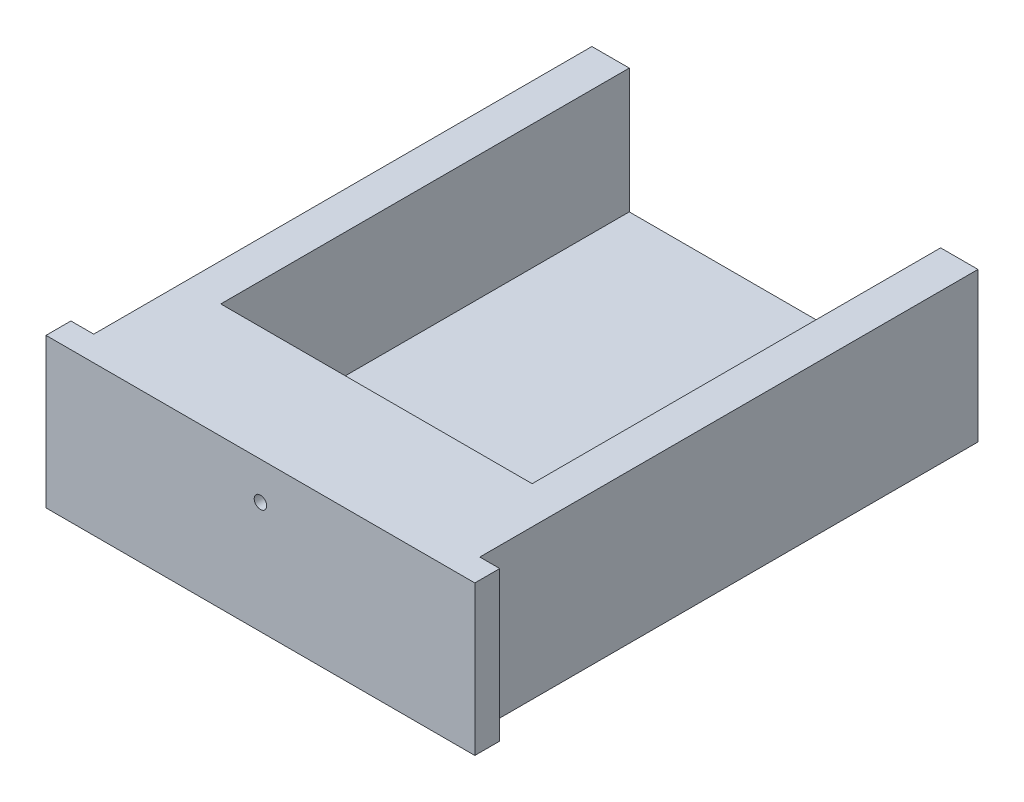
ISO-10303-21;
HEADER;
FILE_DESCRIPTION(('STEP AP214'),'2;1');
FILE_NAME('part.step','',(''),(''),'','','');
FILE_SCHEMA(('AUTOMOTIVE_DESIGN { 1 0 10303 214 1 1 1 1 }'));
ENDSEC;
DATA;
#1=APPLICATION_CONTEXT('core data for automotive mechanical design processes');
#2=APPLICATION_PROTOCOL_DEFINITION('international standard','automotive_design',2000,#1);
#3=PRODUCT_CONTEXT('',#1,'mechanical');
#4=PRODUCT('Part','Part','',(#3));
#5=PRODUCT_RELATED_PRODUCT_CATEGORY('part','',(#4));
#6=PRODUCT_DEFINITION_FORMATION('','',#4);
#7=PRODUCT_DEFINITION_CONTEXT('part definition',#1,'design');
#8=PRODUCT_DEFINITION('design','',#6,#7);
#9=PRODUCT_DEFINITION_SHAPE('','',#8);
#10=(LENGTH_UNIT() NAMED_UNIT(*) SI_UNIT(.MILLI.,.METRE.));
#11=(NAMED_UNIT(*) PLANE_ANGLE_UNIT() SI_UNIT($,.RADIAN.));
#12=(NAMED_UNIT(*) SI_UNIT($,.STERADIAN.) SOLID_ANGLE_UNIT());
#13=UNCERTAINTY_MEASURE_WITH_UNIT(LENGTH_MEASURE(1.E-05),#10,'distance_accuracy_value','');
#14=(GEOMETRIC_REPRESENTATION_CONTEXT(3) GLOBAL_UNCERTAINTY_ASSIGNED_CONTEXT((#13)) GLOBAL_UNIT_ASSIGNED_CONTEXT((#10,
#11,#12)) REPRESENTATION_CONTEXT('',''));
#15=CARTESIAN_POINT('',(0.,0.,0.));
#16=DIRECTION('',(0.,0.,1.));
#17=DIRECTION('',(1.,0.,0.));
#18=AXIS2_PLACEMENT_3D('',#15,#16,#17);
#19=CARTESIAN_POINT('',(-3.42735177070523E-08,0.000254637693108169,-31.9670401722792));
#20=DIRECTION('',(1.07215173883023E-09,-7.96563246793503E-06,0.999999999968274));
#21=DIRECTION('',(0.,-0.999999999968274,-7.96563246793503E-06));
#22=AXIS2_PLACEMENT_3D('',#19,#20,#21);
#23=PLANE('',#22);
#24=DIRECTION('',(6.33565677667582E-07,0.999999999968074,7.96563246725415E-06));
#25=VECTOR('',#24,1.);
#26=CARTESIAN_POINT('',(114.480598006677,85.6570226949698,-31.966357984687));
#27=LINE('',#26,#25);
#28=CARTESIAN_POINT('',(114.480598006677,85.6570226949698,-31.966357984687));
#29=VERTEX_POINT('',#28);
#30=CARTESIAN_POINT('',(114.480601808071,91.6570217444309,-31.9663101908998));
#31=VERTEX_POINT('',#30);
#32=EDGE_CURVE('E181',#29,#31,#27,.T.);
#33=ORIENTED_EDGE('',*,*,#32,.F.);
#34=DIRECTION('',(1.,0.,-1.07215222363291E-09));
#35=VECTOR('',#34,1.);
#36=CARTESIAN_POINT('',(98.9805980066739,85.6570226949701,-31.9663579680687));
#37=LINE('',#36,#35);
#38=CARTESIAN_POINT('',(98.9805980066739,85.6570226949701,-31.9663579680687));
#39=VERTEX_POINT('',#38);
#40=EDGE_CURVE('E164',#39,#29,#37,.T.);
#41=ORIENTED_EDGE('',*,*,#40,.F.);
#42=DIRECTION('',(-6.33565676773696E-07,-0.999999999968074,-7.96563246728856E-06));
#43=VECTOR('',#42,1.);
#44=CARTESIAN_POINT('',(98.9805980066739,85.6570226949701,-31.9663579680687));
#45=LINE('',#44,#43);
#46=CARTESIAN_POINT('',(98.9806018080679,91.6570226947797,-31.9663101742739));
#47=VERTEX_POINT('',#46);
#48=EDGE_CURVE('E166',#47,#39,#45,.T.);
#49=ORIENTED_EDGE('',*,*,#48,.F.);
#50=DIRECTION('',(-1.,0.,1.07215162673905E-09));
#51=VECTOR('',#50,1.);
#52=CARTESIAN_POINT('',(98.9806018080679,91.6570226947797,-31.9663101742739));
#53=LINE('',#52,#51);
#54=CARTESIAN_POINT('',(100.480601808068,91.6570226947797,-31.9663101758821));
#55=VERTEX_POINT('',#54);
#56=EDGE_CURVE('E169',#55,#47,#53,.T.);
#57=ORIENTED_EDGE('',*,*,#56,.F.);
#58=DIRECTION('',(0.,0.999999999968274,7.96563246752145E-06));
#59=VECTOR('',#58,1.);
#60=CARTESIAN_POINT('',(100.480601808068,86.6570226949383,-31.9663500040444));
#61=LINE('',#60,#59);
#62=CARTESIAN_POINT('',(100.480601808068,86.6570226949383,-31.9663500040444));
#63=VERTEX_POINT('',#62);
#64=EDGE_CURVE('E172',#63,#55,#61,.T.);
#65=ORIENTED_EDGE('',*,*,#64,.F.);
#66=DIRECTION('',(-1.,0.,1.07215236993775E-09));
#67=VECTOR('',#66,1.);
#68=CARTESIAN_POINT('',(100.480601808068,86.6570226949383,-31.9663500040444));
#69=LINE('',#68,#67);
#70=CARTESIAN_POINT('',(112.980601772508,86.6570226949381,-31.9663500174463));
#71=VERTEX_POINT('',#70);
#72=EDGE_CURVE('E175',#71,#63,#69,.T.);
#73=ORIENTED_EDGE('',*,*,#72,.F.);
#74=DIRECTION('',(0.,-0.999999999968274,-7.96563246752145E-06));
#75=VECTOR('',#74,1.);
#76=CARTESIAN_POINT('',(112.980601772508,86.6570226949381,-31.9663500174463));
#77=LINE('',#76,#75);
#78=CARTESIAN_POINT('',(112.980601772508,91.6570226947795,-31.966310189284));
#79=VERTEX_POINT('',#78);
#80=EDGE_CURVE('E178',#79,#71,#77,.T.);
#81=ORIENTED_EDGE('',*,*,#80,.F.);
#82=DIRECTION('',(-0.999999999999799,6.33565657127065E-07,1.07719849003317E-09));
#83=VECTOR('',#82,1.);
#84=CARTESIAN_POINT('',(114.480601808071,91.6570217444309,-31.9663101908998));
#85=LINE('',#84,#83);
#86=EDGE_CURVE('E151',#31,#79,#85,.T.);
#87=ORIENTED_EDGE('',*,*,#86,.F.);
#88=EDGE_LOOP('',(#33,#41,#49,#57,#65,#73,#81,#87));
#89=FACE_BOUND('',#88,.T.);
#90=ADVANCED_FACE('F38',(#89),#23,.F.);
#91=CARTESIAN_POINT('',(98.9805980459369,85.6567309873462,4.65441571442586));
#92=DIRECTION('',(0.,0.999999999968274,7.96563246749308E-06));
#93=DIRECTION('',(0.,-7.96563246749308E-06,0.999999999968274));
#94=AXIS2_PLACEMENT_3D('',#91,#92,#93);
#95=PLANE('',#94);
#96=DIRECTION('',(-1.07215221318086E-09,7.96563246749308E-06,-0.999999999968274));
#97=VECTOR('',#96,1.);
#98=CARTESIAN_POINT('',(114.48059804594,85.656730987346,4.6544156978075));
#99=LINE('',#98,#97);
#100=CARTESIAN_POINT('',(114.48059804594,85.6568633823204,-11.9663579853215));
#101=VERTEX_POINT('',#100);
#102=EDGE_CURVE('E61',#101,#29,#99,.T.);
#103=ORIENTED_EDGE('',*,*,#102,.F.);
#104=DIRECTION('',(1.,0.,-1.07215214306841E-09));
#105=VECTOR('',#104,1.);
#106=CARTESIAN_POINT('',(98.0647317711492,85.6568633823203,-11.9663579677212));
#107=LINE('',#106,#105);
#108=CARTESIAN_POINT('',(115.280601829515,85.6568633823205,-11.9663579861793));
#109=VERTEX_POINT('',#108);
#110=EDGE_CURVE('E55',#101,#109,#107,.T.);
#111=ORIENTED_EDGE('',*,*,#110,.T.);
#112=DIRECTION('',(-1.07215221318086E-09,7.96563246749308E-06,-0.999999999968274));
#113=VECTOR('',#112,1.);
#114=CARTESIAN_POINT('',(115.280601830587,85.656855416688,-10.966357986211));
#115=LINE('',#114,#113);
#116=CARTESIAN_POINT('',(115.280601830587,85.656855416688,-10.966357986211));
#117=VERTEX_POINT('',#116);
#118=EDGE_CURVE('E188',#117,#109,#115,.T.);
#119=ORIENTED_EDGE('',*,*,#118,.F.);
#120=DIRECTION('',(1.,0.,-1.07215214306841E-09));
#121=VECTOR('',#120,1.);
#122=CARTESIAN_POINT('',(98.0647317722213,85.6568554166878,-10.966357967753));
#123=LINE('',#122,#121);
#124=CARTESIAN_POINT('',(98.0647317722213,85.6568554166878,-10.966357967753));
#125=VERTEX_POINT('',#124);
#126=EDGE_CURVE('E214',#125,#117,#123,.T.);
#127=ORIENTED_EDGE('',*,*,#126,.F.);
#128=DIRECTION('',(-1.07215221318086E-09,7.96563246749308E-06,-0.999999999968274));
#129=VECTOR('',#128,1.);
#130=CARTESIAN_POINT('',(98.0647317722213,85.6568554166878,-10.966357967753));
#131=LINE('',#130,#129);
#132=CARTESIAN_POINT('',(98.0647317711492,85.6568633823203,-11.9663579677212));
#133=VERTEX_POINT('',#132);
#134=EDGE_CURVE('E182',#125,#133,#131,.T.);
#135=ORIENTED_EDGE('',*,*,#134,.T.);
#136=CARTESIAN_POINT('',(98.980599928814,85.6568633823203,-11.9663579687032));
#137=VERTEX_POINT('',#136);
#138=EDGE_CURVE('E205',#133,#137,#107,.T.);
#139=ORIENTED_EDGE('',*,*,#138,.T.);
#140=DIRECTION('',(-1.07215221318086E-09,7.96563246749308E-06,-0.999999999968274));
#141=VECTOR('',#140,1.);
#142=CARTESIAN_POINT('',(98.9805980459369,85.6567309873462,4.65441571442586));
#143=LINE('',#142,#141);
#144=EDGE_CURVE('E161',#137,#39,#143,.T.);
#145=ORIENTED_EDGE('',*,*,#144,.T.);
#146=ORIENTED_EDGE('',*,*,#40,.T.);
#147=EDGE_LOOP('',(#103,#111,#119,#127,#135,#139,#145,#146));
#148=FACE_BOUND('',#147,.T.);
#149=ADVANCED_FACE('F244',(#148),#95,.F.);
#150=CARTESIAN_POINT('',(98.9805980459369,85.6567309873462,4.65441571442586));
#151=DIRECTION('',(0.999999999999799,-6.33565668213226E-07,-1.07719896447183E-09));
#152=DIRECTION('',(6.33565668213226E-07,0.999999999999799,0.));
#153=AXIS2_PLACEMENT_3D('',#150,#151,#152);
#154=PLANE('',#153);
#155=ORIENTED_EDGE('',*,*,#144,.F.);
#156=DIRECTION('',(6.33565676773696E-07,0.999999999968074,7.9656324668122E-06));
#157=VECTOR('',#156,1.);
#158=CARTESIAN_POINT('',(98.9805980281169,85.6568633823207,-11.9663579687032));
#159=LINE('',#158,#157);
#160=CARTESIAN_POINT('',(98.980599928814,91.6568633821304,-11.9663101749084));
#161=VERTEX_POINT('',#160);
#162=EDGE_CURVE('E47',#137,#161,#159,.T.);
#163=ORIENTED_EDGE('',*,*,#162,.T.);
#164=DIRECTION('',(-1.07215221318086E-09,7.96563246749308E-06,-0.999999999968274));
#165=VECTOR('',#164,1.);
#166=CARTESIAN_POINT('',(98.980601847331,91.6567309871559,4.65446350822066));
#167=LINE('',#166,#165);
#168=EDGE_CURVE('E159',#161,#47,#167,.T.);
#169=ORIENTED_EDGE('',*,*,#168,.T.);
#170=ORIENTED_EDGE('',*,*,#48,.T.);
#171=EDGE_LOOP('',(#155,#163,#169,#170));
#172=FACE_BOUND('',#171,.T.);
#173=ADVANCED_FACE('F254',(#172),#154,.F.);
#174=CARTESIAN_POINT('',(98.980601847331,91.6567309871559,4.65446350822066));
#175=DIRECTION('',(0.,-0.999999999968274,-7.96563246749308E-06));
#176=DIRECTION('',(0.,7.96563246749308E-06,-0.999999999968274));
#177=AXIS2_PLACEMENT_3D('',#174,#175,#176);
#178=PLANE('',#177);
#179=DIRECTION('',(1.,0.,-1.07215209238199E-09));
#180=VECTOR('',#179,1.);
#181=CARTESIAN_POINT('',(100.480601834561,91.6568920584073,-15.5663101764024));
#182=LINE('',#181,#180);
#183=CARTESIAN_POINT('',(100.480601834561,91.6568920584073,-15.5663101764024));
#184=VERTEX_POINT('',#183);
#185=CARTESIAN_POINT('',(112.980601799002,91.6568920584074,-15.5663101898043));
#186=VERTEX_POINT('',#185);
#187=EDGE_CURVE('E128',#184,#186,#182,.T.);
#188=ORIENTED_EDGE('',*,*,#187,.F.);
#189=DIRECTION('',(-1.07215221318086E-09,7.96563246749308E-06,-0.999999999968274));
#190=VECTOR('',#189,1.);
#191=CARTESIAN_POINT('',(100.480601847331,91.6567309871559,4.65446350661244));
#192=LINE('',#191,#190);
#193=EDGE_CURVE('E157',#184,#55,#192,.T.);
#194=ORIENTED_EDGE('',*,*,#193,.T.);
#195=ORIENTED_EDGE('',*,*,#56,.T.);
#196=ORIENTED_EDGE('',*,*,#168,.F.);
#197=DIRECTION('',(-1.,0.,1.07215224383146E-09));
#198=VECTOR('',#197,1.);
#199=CARTESIAN_POINT('',(98.0647317711492,91.6568633821304,-11.9663101739264));
#200=LINE('',#199,#198);
#201=CARTESIAN_POINT('',(98.0647317711492,91.6568633821304,-11.9663101739264));
#202=VERTEX_POINT('',#201);
#203=EDGE_CURVE('E202',#161,#202,#200,.T.);
#204=ORIENTED_EDGE('',*,*,#203,.T.);
#205=DIRECTION('',(-1.07215221318086E-09,7.96563246749308E-06,-0.999999999968274));
#206=VECTOR('',#205,1.);
#207=CARTESIAN_POINT('',(98.0647317722213,91.6568554164979,-10.9663101739581));
#208=LINE('',#207,#206);
#209=CARTESIAN_POINT('',(98.0647317722213,91.6568554164979,-10.9663101739581));
#210=VERTEX_POINT('',#209);
#211=EDGE_CURVE('E194',#210,#202,#208,.T.);
#212=ORIENTED_EDGE('',*,*,#211,.F.);
#213=DIRECTION('',(-1.,0.,1.07215224383146E-09));
#214=VECTOR('',#213,1.);
#215=CARTESIAN_POINT('',(98.0647317722213,91.6568554164979,-10.9663101739581));
#216=LINE('',#215,#214);
#217=CARTESIAN_POINT('',(115.280601830587,91.656855416498,-10.9663101924162));
#218=VERTEX_POINT('',#217);
#219=EDGE_CURVE('E197',#218,#210,#216,.T.);
#220=ORIENTED_EDGE('',*,*,#219,.F.);
#221=DIRECTION('',(-1.07215221318086E-09,7.96563246749308E-06,-0.999999999968274));
#222=VECTOR('',#221,1.);
#223=CARTESIAN_POINT('',(115.280601830587,91.656855416498,-10.9663101924162));
#224=LINE('',#223,#222);
#225=CARTESIAN_POINT('',(115.280601829515,91.6568633821305,-11.9663101923845));
#226=VERTEX_POINT('',#225);
#227=EDGE_CURVE('E191',#218,#226,#224,.T.);
#228=ORIENTED_EDGE('',*,*,#227,.T.);
#229=CARTESIAN_POINT('',(114.480599946637,91.6568633821305,-11.9663101915267));
#230=VERTEX_POINT('',#229);
#231=EDGE_CURVE('E198',#226,#230,#200,.T.);
#232=ORIENTED_EDGE('',*,*,#231,.T.);
#233=DIRECTION('',(-1.07215221318086E-09,7.96563246749308E-06,-0.999999999968274));
#234=VECTOR('',#233,1.);
#235=CARTESIAN_POINT('',(114.480601847334,91.6567300368071,4.65446349159473));
#236=LINE('',#235,#234);
#237=EDGE_CURVE('E42',#230,#31,#236,.T.);
#238=ORIENTED_EDGE('',*,*,#237,.T.);
#239=ORIENTED_EDGE('',*,*,#86,.T.);
#240=DIRECTION('',(-1.07215221318086E-09,7.96563246749308E-06,-0.999999999968274));
#241=VECTOR('',#240,1.);
#242=CARTESIAN_POINT('',(112.980601811772,91.6567309871556,4.65446349321053));
#243=LINE('',#242,#241);
#244=EDGE_CURVE('E144',#186,#79,#243,.T.);
#245=ORIENTED_EDGE('',*,*,#244,.F.);
#246=EDGE_LOOP('',(#188,#194,#195,#196,#204,#212,#220,#228,#232,#238,#239,#245));
#247=FACE_BOUND('',#246,.T.);
#248=ADVANCED_FACE('F149',(#247),#178,.F.);
#249=CARTESIAN_POINT('',(100.480601847331,86.6567309873145,4.6544236784501));
#250=DIRECTION('',(-1.,0.,1.07215221336794E-09));
#251=DIRECTION('',(1.07215221336794E-09,0.,1.));
#252=AXIS2_PLACEMENT_3D('',#249,#250,#251);
#253=PLANE('',#252);
#254=ORIENTED_EDGE('',*,*,#193,.F.);
#255=DIRECTION('',(1.78201342571069E-09,0.999999999968274,7.96563246752134E-06));
#256=VECTOR('',#255,1.);
#257=CARTESIAN_POINT('',(100.480601825651,86.6568920585658,-15.5663500045647));
#258=LINE('',#257,#256);
#259=CARTESIAN_POINT('',(100.480601825651,86.6568920585658,-15.5663500045647));
#260=VERTEX_POINT('',#259);
#261=EDGE_CURVE('E134',#260,#184,#258,.T.);
#262=ORIENTED_EDGE('',*,*,#261,.F.);
#263=DIRECTION('',(-1.07215221318086E-09,7.96563246749308E-06,-0.999999999968274));
#264=VECTOR('',#263,1.);
#265=CARTESIAN_POINT('',(100.480601847331,86.6567309873145,4.6544236784501));
#266=LINE('',#265,#264);
#267=EDGE_CURVE('E153',#260,#63,#266,.T.);
#268=ORIENTED_EDGE('',*,*,#267,.T.);
#269=ORIENTED_EDGE('',*,*,#64,.T.);
#270=EDGE_LOOP('',(#254,#262,#268,#269));
#271=FACE_BOUND('',#270,.T.);
#272=ADVANCED_FACE('F281',(#271),#253,.F.);
#273=CARTESIAN_POINT('',(100.480601847331,86.6567309873145,4.6544236784501));
#274=DIRECTION('',(0.,-0.999999999968274,-7.96563246749308E-06));
#275=DIRECTION('',(0.,7.96563246749308E-06,-0.999999999968274));
#276=AXIS2_PLACEMENT_3D('',#273,#274,#275);
#277=PLANE('',#276);
#278=ORIENTED_EDGE('',*,*,#267,.F.);
#279=DIRECTION('',(-1.,0.,1.07215222963141E-09));
#280=VECTOR('',#279,1.);
#281=CARTESIAN_POINT('',(112.980601807912,86.6568920585656,-15.5663500179666));
#282=LINE('',#281,#280);
#283=CARTESIAN_POINT('',(112.980601807912,86.6568920585656,-15.5663500179666));
#284=VERTEX_POINT('',#283);
#285=EDGE_CURVE('E147',#284,#260,#282,.T.);
#286=ORIENTED_EDGE('',*,*,#285,.F.);
#287=DIRECTION('',(-1.07215221318086E-09,7.96563246749308E-06,-0.999999999968274));
#288=VECTOR('',#287,1.);
#289=CARTESIAN_POINT('',(112.980601811771,86.6567309873142,4.65442366504819));
#290=LINE('',#289,#288);
#291=EDGE_CURVE('E146',#284,#71,#290,.T.);
#292=ORIENTED_EDGE('',*,*,#291,.T.);
#293=ORIENTED_EDGE('',*,*,#72,.T.);
#294=EDGE_LOOP('',(#278,#286,#292,#293));
#295=FACE_BOUND('',#294,.T.);
#296=ADVANCED_FACE('F284',(#295),#277,.F.);
#297=CARTESIAN_POINT('',(112.980601811771,86.6567309873142,4.65442366504819));
#298=DIRECTION('',(1.,0.,-1.07215221334583E-09));
#299=DIRECTION('',(-1.07215221334583E-09,0.,-1.));
#300=AXIS2_PLACEMENT_3D('',#297,#298,#299);
#301=PLANE('',#300);
#302=ORIENTED_EDGE('',*,*,#291,.F.);
#303=DIRECTION('',(1.78198567013495E-09,-0.999999999968274,-7.96563246786775E-06));
#304=VECTOR('',#303,1.);
#305=CARTESIAN_POINT('',(112.980601799002,91.6568920584074,-15.5663101898043));
#306=LINE('',#305,#304);
#307=EDGE_CURVE('E131',#186,#284,#306,.T.);
#308=ORIENTED_EDGE('',*,*,#307,.F.);
#309=ORIENTED_EDGE('',*,*,#244,.T.);
#310=ORIENTED_EDGE('',*,*,#80,.T.);
#311=EDGE_LOOP('',(#302,#308,#309,#310));
#312=FACE_BOUND('',#311,.T.);
#313=ADVANCED_FACE('F142',(#312),#301,.F.);
#314=CARTESIAN_POINT('',(114.48059804594,85.656730987346,4.6544156978075));
#315=DIRECTION('',(-0.999999999999799,6.33565669107111E-07,1.07719896447895E-09));
#316=DIRECTION('',(-6.33565669107111E-07,-0.999999999999799,0.));
#317=AXIS2_PLACEMENT_3D('',#314,#315,#316);
#318=PLANE('',#317);
#319=ORIENTED_EDGE('',*,*,#237,.F.);
#320=DIRECTION('',(-6.33565677667582E-07,-0.999999999968074,-7.9656324668122E-06));
#321=VECTOR('',#320,1.);
#322=CARTESIAN_POINT('',(114.48059802812,85.6568633823204,-11.9663579853215));
#323=LINE('',#322,#321);
#324=EDGE_CURVE('E11',#230,#101,#323,.T.);
#325=ORIENTED_EDGE('',*,*,#324,.T.);
#326=ORIENTED_EDGE('',*,*,#102,.T.);
#327=ORIENTED_EDGE('',*,*,#32,.T.);
#328=EDGE_LOOP('',(#319,#325,#326,#327));
#329=FACE_BOUND('',#328,.T.);
#330=ADVANCED_FACE('F40',(#329),#318,.F.);
#331=CARTESIAN_POINT('',(-1.28304877684973E-08,9.53250437452042E-05,-11.9670401729136));
#332=DIRECTION('',(1.07215214311145E-09,-7.96563246757874E-06,0.999999999968274));
#333=DIRECTION('',(0.,-0.999999999968274,-7.96563246757874E-06));
#334=AXIS2_PLACEMENT_3D('',#331,#332,#333);
#335=PLANE('',#334);
#336=ORIENTED_EDGE('',*,*,#162,.F.);
#337=ORIENTED_EDGE('',*,*,#138,.F.);
#338=DIRECTION('',(0.,-0.999999999968274,-7.96563246757874E-06));
#339=VECTOR('',#338,1.);
#340=CARTESIAN_POINT('',(98.0647317711492,91.6568633821304,-11.9663101739264));
#341=LINE('',#340,#339);
#342=EDGE_CURVE('E208',#202,#133,#341,.T.);
#343=ORIENTED_EDGE('',*,*,#342,.F.);
#344=ORIENTED_EDGE('',*,*,#203,.F.);
#345=EDGE_LOOP('',(#336,#337,#343,#344));
#346=FACE_BOUND('',#345,.T.);
#347=ADVANCED_FACE('F252',(#346),#335,.F.);
#348=CARTESIAN_POINT('',(98.0647317722213,91.6568554164979,-10.9663101739581));
#349=DIRECTION('',(1.,0.,-1.07215221314685E-09));
#350=DIRECTION('',(-1.07215221314685E-09,0.,-1.));
#351=AXIS2_PLACEMENT_3D('',#348,#349,#350);
#352=PLANE('',#351);
#353=ORIENTED_EDGE('',*,*,#342,.T.);
#354=ORIENTED_EDGE('',*,*,#134,.F.);
#355=DIRECTION('',(0.,-0.999999999968274,-7.96563246757874E-06));
#356=VECTOR('',#355,1.);
#357=CARTESIAN_POINT('',(98.0647317722213,91.6568554164979,-10.9663101739581));
#358=LINE('',#357,#356);
#359=EDGE_CURVE('E201',#210,#125,#358,.T.);
#360=ORIENTED_EDGE('',*,*,#359,.F.);
#361=ORIENTED_EDGE('',*,*,#211,.T.);
#362=EDGE_LOOP('',(#353,#354,#360,#361));
#363=FACE_BOUND('',#362,.T.);
#364=ADVANCED_FACE('F241',(#363),#352,.F.);
#365=CARTESIAN_POINT('',(115.280601830587,91.656855416498,-10.9663101924162));
#366=DIRECTION('',(-1.,0.,1.07215221314685E-09));
#367=DIRECTION('',(1.07215221314685E-09,0.,1.));
#368=AXIS2_PLACEMENT_3D('',#365,#366,#367);
#369=PLANE('',#368);
#370=DIRECTION('',(0.,0.999999999968274,7.96563246728962E-06));
#371=VECTOR('',#370,1.);
#372=CARTESIAN_POINT('',(115.280601829515,91.6568633821305,-11.9663101923845));
#373=LINE('',#372,#371);
#374=EDGE_CURVE('E203',#109,#226,#373,.T.);
#375=ORIENTED_EDGE('',*,*,#374,.T.);
#376=ORIENTED_EDGE('',*,*,#227,.F.);
#377=DIRECTION('',(0.,0.999999999968274,7.96563246728962E-06));
#378=VECTOR('',#377,1.);
#379=CARTESIAN_POINT('',(115.280601830587,91.656855416498,-10.9663101924162));
#380=LINE('',#379,#378);
#381=EDGE_CURVE('E212',#117,#218,#380,.T.);
#382=ORIENTED_EDGE('',*,*,#381,.F.);
#383=ORIENTED_EDGE('',*,*,#118,.T.);
#384=EDGE_LOOP('',(#375,#376,#382,#383));
#385=FACE_BOUND('',#384,.T.);
#386=ADVANCED_FACE('F233',(#385),#369,.F.);
#387=CARTESIAN_POINT('',(-1.17583355553164E-08,8.73594112777112E-05,-10.9670401729454));
#388=DIRECTION('',(1.07215214311145E-09,-7.96563246757874E-06,0.999999999968274));
#389=DIRECTION('',(0.,-0.999999999968274,-7.96563246757874E-06));
#390=AXIS2_PLACEMENT_3D('',#387,#388,#389);
#391=PLANE('',#390);
#392=CARTESIAN_POINT('',(106.672666801404,90.1568554165454,-10.9663221316359));
#393=DIRECTION('',(1.07215214472963E-09,-7.96563246757874E-06,0.999999999968274));
#394=DIRECTION('',(0.,-0.999999999968274,-7.96563246757874E-06));
#395=AXIS2_PLACEMENT_3D('',#392,#393,#394);
#396=CIRCLE('',#395,0.249999999999989);
#397=CARTESIAN_POINT('',(106.672666801404,89.9068554165533,-10.966324123044));
#398=VERTEX_POINT('',#397);
#399=EDGE_CURVE('E222',#398,#398,#396,.T.);
#400=ORIENTED_EDGE('',*,*,#399,.F.);
#401=EDGE_LOOP('',(#400));
#402=FACE_BOUND('',#401,.T.);
#403=ORIENTED_EDGE('',*,*,#359,.T.);
#404=ORIENTED_EDGE('',*,*,#126,.T.);
#405=ORIENTED_EDGE('',*,*,#381,.T.);
#406=ORIENTED_EDGE('',*,*,#219,.T.);
#407=EDGE_LOOP('',(#403,#404,#405,#406));
#408=FACE_BOUND('',#407,.T.);
#409=ADVANCED_FACE('F229',(#402,#408),#391,.T.);
#410=ORIENTED_EDGE('',*,*,#324,.F.);
#411=ORIENTED_EDGE('',*,*,#231,.F.);
#412=ORIENTED_EDGE('',*,*,#374,.F.);
#413=ORIENTED_EDGE('',*,*,#110,.F.);
#414=EDGE_LOOP('',(#410,#411,#412,#413));
#415=FACE_BOUND('',#414,.T.);
#416=ADVANCED_FACE('F232',(#415),#335,.F.);
#417=CARTESIAN_POINT('',(-1.66902348828794E-08,0.000124001320631924,-15.5670401727995));
#418=DIRECTION('',(-1.07215209241873E-09,7.96563246786584E-06,-0.999999999968274));
#419=DIRECTION('',(0.,0.999999999968274,7.96563246786584E-06));
#420=AXIS2_PLACEMENT_3D('',#417,#418,#419);
#421=PLANE('',#420);
#422=CARTESIAN_POINT('',(106.672666796472,90.1568920584547,-15.5663221314899));
#423=DIRECTION('',(-1.07215209241873E-09,7.96563246786584E-06,-0.999999999968274));
#424=DIRECTION('',(0.,0.999999999968274,7.96563246786584E-06));
#425=AXIS2_PLACEMENT_3D('',#422,#423,#424);
#426=CIRCLE('',#425,0.249999999999994);
#427=CARTESIAN_POINT('',(106.672666796472,90.4068920584468,-15.5663201400818));
#428=VERTEX_POINT('',#427);
#429=EDGE_CURVE('E138',#428,#428,#426,.T.);
#430=ORIENTED_EDGE('',*,*,#429,.F.);
#431=EDGE_LOOP('',(#430));
#432=FACE_BOUND('',#431,.T.);
#433=ORIENTED_EDGE('',*,*,#187,.T.);
#434=ORIENTED_EDGE('',*,*,#307,.T.);
#435=ORIENTED_EDGE('',*,*,#285,.T.);
#436=ORIENTED_EDGE('',*,*,#261,.T.);
#437=EDGE_LOOP('',(#433,#434,#435,#436));
#438=FACE_BOUND('',#437,.T.);
#439=ADVANCED_FACE('F130',(#432,#438),#421,.T.);
#440=CARTESIAN_POINT('',(106.672666801404,90.1568554165454,-10.9663221316359));
#441=DIRECTION('',(1.07215214472963E-09,-7.96563246757874E-06,0.999999999968274));
#442=DIRECTION('',(0.,-0.999999999968274,-7.96563246757874E-06));
#443=AXIS2_PLACEMENT_3D('',#440,#441,#442);
#444=CYLINDRICAL_SURFACE('',#443,0.249999999999994);
#445=ORIENTED_EDGE('',*,*,#399,.T.);
#446=EDGE_LOOP('',(#445));
#447=FACE_BOUND('',#446,.T.);
#448=ORIENTED_EDGE('',*,*,#429,.T.);
#449=EDGE_LOOP('',(#448));
#450=FACE_BOUND('',#449,.T.);
#451=ADVANCED_FACE('F226',(#447,#450),#444,.F.);
#452=CLOSED_SHELL('',(#90,#149,#173,#248,#272,#296,#313,#330,#347,#364,#386,#409,#416,#439,#451));
#453=MANIFOLD_SOLID_BREP('B2',#452);
#454=ADVANCED_BREP_SHAPE_REPRESENTATION('',(#18,#453),#14);
#455=SHAPE_DEFINITION_REPRESENTATION(#9,#454);
ENDSEC;
END-ISO-10303-21;
